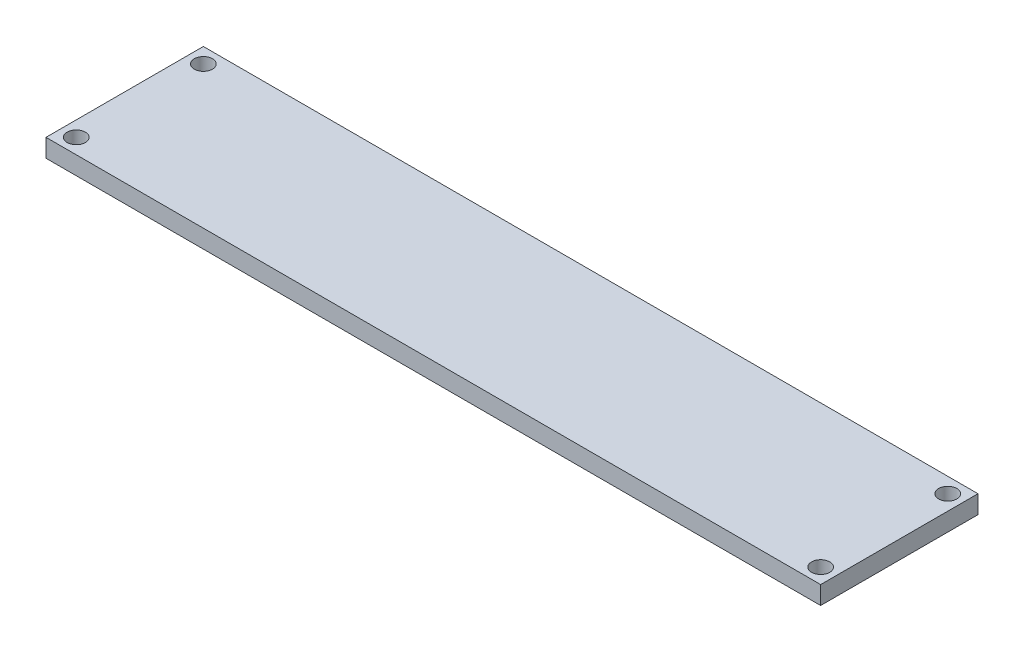
ISO-10303-21;
HEADER;
FILE_DESCRIPTION(('STEP AP214'),'2;1');
FILE_NAME('part.step','',(''),(''),'','','');
FILE_SCHEMA(('AUTOMOTIVE_DESIGN { 1 0 10303 214 1 1 1 1 }'));
ENDSEC;
DATA;
#1=APPLICATION_CONTEXT('core data for automotive mechanical design processes');
#2=APPLICATION_PROTOCOL_DEFINITION('international standard','automotive_design',2000,#1);
#3=PRODUCT_CONTEXT('',#1,'mechanical');
#4=PRODUCT('Part','Part','',(#3));
#5=PRODUCT_RELATED_PRODUCT_CATEGORY('part','',(#4));
#6=PRODUCT_DEFINITION_FORMATION('','',#4);
#7=PRODUCT_DEFINITION_CONTEXT('part definition',#1,'design');
#8=PRODUCT_DEFINITION('design','',#6,#7);
#9=PRODUCT_DEFINITION_SHAPE('','',#8);
#10=(LENGTH_UNIT() NAMED_UNIT(*) SI_UNIT(.MILLI.,.METRE.));
#11=(NAMED_UNIT(*) PLANE_ANGLE_UNIT() SI_UNIT($,.RADIAN.));
#12=(NAMED_UNIT(*) SI_UNIT($,.STERADIAN.) SOLID_ANGLE_UNIT());
#13=UNCERTAINTY_MEASURE_WITH_UNIT(LENGTH_MEASURE(1.E-05),#10,'distance_accuracy_value','');
#14=(GEOMETRIC_REPRESENTATION_CONTEXT(3) GLOBAL_UNCERTAINTY_ASSIGNED_CONTEXT((#13)) GLOBAL_UNIT_ASSIGNED_CONTEXT((#10,
#11,#12)) REPRESENTATION_CONTEXT('',''));
#15=CARTESIAN_POINT('',(0.,0.,0.));
#16=DIRECTION('',(0.,0.,1.));
#17=DIRECTION('',(1.,0.,0.));
#18=AXIS2_PLACEMENT_3D('',#15,#16,#17);
#19=CARTESIAN_POINT('',(64.,-3.,13.));
#20=DIRECTION('',(1.,0.,0.));
#21=DIRECTION('',(0.,0.,-1.));
#22=AXIS2_PLACEMENT_3D('',#19,#20,#21);
#23=PLANE('',#22);
#24=DIRECTION('',(0.,0.,-1.));
#25=VECTOR('',#24,1.);
#26=CARTESIAN_POINT('',(64.,0.,13.));
#27=LINE('',#26,#25);
#28=CARTESIAN_POINT('',(64.,0.,13.));
#29=VERTEX_POINT('',#28);
#30=CARTESIAN_POINT('',(64.,0.,-13.));
#31=VERTEX_POINT('',#30);
#32=EDGE_CURVE('E101',#29,#31,#27,.T.);
#33=ORIENTED_EDGE('',*,*,#32,.F.);
#34=DIRECTION('',(0.,1.,0.));
#35=VECTOR('',#34,1.);
#36=CARTESIAN_POINT('',(64.,-3.,13.));
#37=LINE('',#36,#35);
#38=CARTESIAN_POINT('',(64.,-3.,13.));
#39=VERTEX_POINT('',#38);
#40=EDGE_CURVE('E11',#39,#29,#37,.T.);
#41=ORIENTED_EDGE('',*,*,#40,.F.);
#42=DIRECTION('',(0.,0.,-1.));
#43=VECTOR('',#42,1.);
#44=CARTESIAN_POINT('',(64.,-3.,13.));
#45=LINE('',#44,#43);
#46=CARTESIAN_POINT('',(64.,-3.,-13.));
#47=VERTEX_POINT('',#46);
#48=EDGE_CURVE('E94',#39,#47,#45,.T.);
#49=ORIENTED_EDGE('',*,*,#48,.T.);
#50=DIRECTION('',(0.,1.,0.));
#51=VECTOR('',#50,1.);
#52=CARTESIAN_POINT('',(64.,-3.,-13.));
#53=LINE('',#52,#51);
#54=EDGE_CURVE('E39',#47,#31,#53,.T.);
#55=ORIENTED_EDGE('',*,*,#54,.T.);
#56=EDGE_LOOP('',(#33,#41,#49,#55));
#57=FACE_BOUND('',#56,.T.);
#58=ADVANCED_FACE('F36',(#57),#23,.T.);
#59=CARTESIAN_POINT('',(-64.,-3.,13.));
#60=DIRECTION('',(0.,0.,1.));
#61=DIRECTION('',(1.,0.,0.));
#62=AXIS2_PLACEMENT_3D('',#59,#60,#61);
#63=PLANE('',#62);
#64=DIRECTION('',(1.,0.,0.));
#65=VECTOR('',#64,1.);
#66=CARTESIAN_POINT('',(-64.,0.,13.));
#67=LINE('',#66,#65);
#68=CARTESIAN_POINT('',(-64.,0.,13.));
#69=VERTEX_POINT('',#68);
#70=EDGE_CURVE('E96',#69,#29,#67,.T.);
#71=ORIENTED_EDGE('',*,*,#70,.F.);
#72=DIRECTION('',(0.,1.,0.));
#73=VECTOR('',#72,1.);
#74=CARTESIAN_POINT('',(-64.,-3.,13.));
#75=LINE('',#74,#73);
#76=CARTESIAN_POINT('',(-64.,-3.,13.));
#77=VERTEX_POINT('',#76);
#78=EDGE_CURVE('E45',#77,#69,#75,.T.);
#79=ORIENTED_EDGE('',*,*,#78,.F.);
#80=DIRECTION('',(1.,0.,0.));
#81=VECTOR('',#80,1.);
#82=CARTESIAN_POINT('',(-64.,-3.,13.));
#83=LINE('',#82,#81);
#84=EDGE_CURVE('E91',#77,#39,#83,.T.);
#85=ORIENTED_EDGE('',*,*,#84,.T.);
#86=ORIENTED_EDGE('',*,*,#40,.T.);
#87=EDGE_LOOP('',(#71,#79,#85,#86));
#88=FACE_BOUND('',#87,.T.);
#89=ADVANCED_FACE('F112',(#88),#63,.T.);
#90=CARTESIAN_POINT('',(-64.,-3.,13.));
#91=DIRECTION('',(-1.,0.,0.));
#92=DIRECTION('',(0.,0.,1.));
#93=AXIS2_PLACEMENT_3D('',#90,#91,#92);
#94=PLANE('',#93);
#95=DIRECTION('',(0.,0.,1.));
#96=VECTOR('',#95,1.);
#97=CARTESIAN_POINT('',(-64.,0.,13.));
#98=LINE('',#97,#96);
#99=CARTESIAN_POINT('',(-64.,0.,-13.));
#100=VERTEX_POINT('',#99);
#101=EDGE_CURVE('E86',#100,#69,#98,.T.);
#102=ORIENTED_EDGE('',*,*,#101,.F.);
#103=DIRECTION('',(0.,1.,0.));
#104=VECTOR('',#103,1.);
#105=CARTESIAN_POINT('',(-64.,-3.,-13.));
#106=LINE('',#105,#104);
#107=CARTESIAN_POINT('',(-64.,-3.,-13.));
#108=VERTEX_POINT('',#107);
#109=EDGE_CURVE('E81',#108,#100,#106,.T.);
#110=ORIENTED_EDGE('',*,*,#109,.F.);
#111=DIRECTION('',(0.,0.,1.));
#112=VECTOR('',#111,1.);
#113=CARTESIAN_POINT('',(-64.,-3.,13.));
#114=LINE('',#113,#112);
#115=EDGE_CURVE('E84',#108,#77,#114,.T.);
#116=ORIENTED_EDGE('',*,*,#115,.T.);
#117=ORIENTED_EDGE('',*,*,#78,.T.);
#118=EDGE_LOOP('',(#102,#110,#116,#117));
#119=FACE_BOUND('',#118,.T.);
#120=ADVANCED_FACE('F83',(#119),#94,.T.);
#121=CARTESIAN_POINT('',(-64.,-3.,-13.));
#122=DIRECTION('',(0.,0.,-1.));
#123=DIRECTION('',(-1.,0.,0.));
#124=AXIS2_PLACEMENT_3D('',#121,#122,#123);
#125=PLANE('',#124);
#126=DIRECTION('',(-1.,0.,0.));
#127=VECTOR('',#126,1.);
#128=CARTESIAN_POINT('',(-64.,0.,-13.));
#129=LINE('',#128,#127);
#130=EDGE_CURVE('E104',#31,#100,#129,.T.);
#131=ORIENTED_EDGE('',*,*,#130,.F.);
#132=ORIENTED_EDGE('',*,*,#54,.F.);
#133=DIRECTION('',(-1.,0.,0.));
#134=VECTOR('',#133,1.);
#135=CARTESIAN_POINT('',(-64.,-3.,-13.));
#136=LINE('',#135,#134);
#137=EDGE_CURVE('E90',#47,#108,#136,.T.);
#138=ORIENTED_EDGE('',*,*,#137,.T.);
#139=ORIENTED_EDGE('',*,*,#109,.T.);
#140=EDGE_LOOP('',(#131,#132,#138,#139));
#141=FACE_BOUND('',#140,.T.);
#142=ADVANCED_FACE('F93',(#141),#125,.T.);
#143=CARTESIAN_POINT('',(0.,-3.,0.));
#144=DIRECTION('',(0.,-1.,0.));
#145=DIRECTION('',(0.,0.,-1.));
#146=AXIS2_PLACEMENT_3D('',#143,#144,#145);
#147=PLANE('',#146);
#148=CARTESIAN_POINT('',(-61.5,-3.,10.5));
#149=DIRECTION('',(0.,1.,0.));
#150=DIRECTION('',(0.,0.,1.));
#151=AXIS2_PLACEMENT_3D('',#148,#149,#150);
#152=CIRCLE('',#151,1.5);
#153=CARTESIAN_POINT('',(-61.5,-3.,12.));
#154=VERTEX_POINT('',#153);
#155=EDGE_CURVE('E153',#154,#154,#152,.T.);
#156=ORIENTED_EDGE('',*,*,#155,.T.);
#157=EDGE_LOOP('',(#156));
#158=FACE_BOUND('',#157,.T.);
#159=CARTESIAN_POINT('',(61.5,-3.,10.5));
#160=DIRECTION('',(0.,1.,0.));
#161=DIRECTION('',(0.,0.,1.));
#162=AXIS2_PLACEMENT_3D('',#159,#160,#161);
#163=CIRCLE('',#162,1.49999999999999);
#164=CARTESIAN_POINT('',(61.5,-3.,12.));
#165=VERTEX_POINT('',#164);
#166=EDGE_CURVE('E161',#165,#165,#163,.T.);
#167=ORIENTED_EDGE('',*,*,#166,.T.);
#168=EDGE_LOOP('',(#167));
#169=FACE_BOUND('',#168,.T.);
#170=CARTESIAN_POINT('',(61.5,-3.,-10.5));
#171=DIRECTION('',(0.,1.,0.));
#172=DIRECTION('',(0.,0.,1.));
#173=AXIS2_PLACEMENT_3D('',#170,#171,#172);
#174=CIRCLE('',#173,1.49999999999999);
#175=CARTESIAN_POINT('',(61.5,-3.,-9.00000000000001));
#176=VERTEX_POINT('',#175);
#177=EDGE_CURVE('E167',#176,#176,#174,.T.);
#178=ORIENTED_EDGE('',*,*,#177,.T.);
#179=EDGE_LOOP('',(#178));
#180=FACE_BOUND('',#179,.T.);
#181=CARTESIAN_POINT('',(-61.5,-3.,-10.5));
#182=DIRECTION('',(0.,1.,0.));
#183=DIRECTION('',(0.,0.,1.));
#184=AXIS2_PLACEMENT_3D('',#181,#182,#183);
#185=CIRCLE('',#184,1.5);
#186=CARTESIAN_POINT('',(-61.5,-3.,-9.));
#187=VERTEX_POINT('',#186);
#188=EDGE_CURVE('E105',#187,#187,#185,.T.);
#189=ORIENTED_EDGE('',*,*,#188,.T.);
#190=EDGE_LOOP('',(#189));
#191=FACE_BOUND('',#190,.T.);
#192=ORIENTED_EDGE('',*,*,#48,.F.);
#193=ORIENTED_EDGE('',*,*,#84,.F.);
#194=ORIENTED_EDGE('',*,*,#115,.F.);
#195=ORIENTED_EDGE('',*,*,#137,.F.);
#196=EDGE_LOOP('',(#192,#193,#194,#195));
#197=FACE_BOUND('',#196,.T.);
#198=ADVANCED_FACE('F89',(#158,#169,#180,#191,#197),#147,.T.);
#199=CARTESIAN_POINT('',(0.,0.,0.));
#200=DIRECTION('',(0.,-1.,0.));
#201=DIRECTION('',(0.,0.,-1.));
#202=AXIS2_PLACEMENT_3D('',#199,#200,#201);
#203=PLANE('',#202);
#204=CARTESIAN_POINT('',(-61.5,0.,10.5));
#205=DIRECTION('',(0.,1.,0.));
#206=DIRECTION('',(0.,0.,1.));
#207=AXIS2_PLACEMENT_3D('',#204,#205,#206);
#208=CIRCLE('',#207,1.5);
#209=CARTESIAN_POINT('',(-61.5,0.,12.));
#210=VERTEX_POINT('',#209);
#211=EDGE_CURVE('E156',#210,#210,#208,.T.);
#212=ORIENTED_EDGE('',*,*,#211,.F.);
#213=EDGE_LOOP('',(#212));
#214=FACE_BOUND('',#213,.T.);
#215=CARTESIAN_POINT('',(61.5,0.,10.5));
#216=DIRECTION('',(0.,1.,0.));
#217=DIRECTION('',(0.,0.,1.));
#218=AXIS2_PLACEMENT_3D('',#215,#216,#217);
#219=CIRCLE('',#218,1.49999999999999);
#220=CARTESIAN_POINT('',(61.5,0.,12.));
#221=VERTEX_POINT('',#220);
#222=EDGE_CURVE('E158',#221,#221,#219,.T.);
#223=ORIENTED_EDGE('',*,*,#222,.F.);
#224=EDGE_LOOP('',(#223));
#225=FACE_BOUND('',#224,.T.);
#226=CARTESIAN_POINT('',(61.5,0.,-10.5));
#227=DIRECTION('',(0.,1.,0.));
#228=DIRECTION('',(0.,0.,1.));
#229=AXIS2_PLACEMENT_3D('',#226,#227,#228);
#230=CIRCLE('',#229,1.49999999999999);
#231=CARTESIAN_POINT('',(61.5,0.,-9.00000000000001));
#232=VERTEX_POINT('',#231);
#233=EDGE_CURVE('E164',#232,#232,#230,.T.);
#234=ORIENTED_EDGE('',*,*,#233,.F.);
#235=EDGE_LOOP('',(#234));
#236=FACE_BOUND('',#235,.T.);
#237=CARTESIAN_POINT('',(-61.5,0.,-10.5));
#238=DIRECTION('',(0.,1.,0.));
#239=DIRECTION('',(0.,0.,1.));
#240=AXIS2_PLACEMENT_3D('',#237,#238,#239);
#241=CIRCLE('',#240,1.5);
#242=CARTESIAN_POINT('',(-61.5,0.,-9.));
#243=VERTEX_POINT('',#242);
#244=EDGE_CURVE('E170',#243,#243,#241,.T.);
#245=ORIENTED_EDGE('',*,*,#244,.F.);
#246=EDGE_LOOP('',(#245));
#247=FACE_BOUND('',#246,.T.);
#248=ORIENTED_EDGE('',*,*,#32,.T.);
#249=ORIENTED_EDGE('',*,*,#130,.T.);
#250=ORIENTED_EDGE('',*,*,#101,.T.);
#251=ORIENTED_EDGE('',*,*,#70,.T.);
#252=EDGE_LOOP('',(#248,#249,#250,#251));
#253=FACE_BOUND('',#252,.T.);
#254=ADVANCED_FACE('F111',(#214,#225,#236,#247,#253),#203,.F.);
#255=CARTESIAN_POINT('',(-61.5,-3.,-10.5));
#256=DIRECTION('',(0.,1.,0.));
#257=DIRECTION('',(0.,0.,1.));
#258=AXIS2_PLACEMENT_3D('',#255,#256,#257);
#259=CYLINDRICAL_SURFACE('',#258,1.5);
#260=ORIENTED_EDGE('',*,*,#188,.F.);
#261=EDGE_LOOP('',(#260));
#262=FACE_BOUND('',#261,.T.);
#263=ORIENTED_EDGE('',*,*,#244,.T.);
#264=EDGE_LOOP('',(#263));
#265=FACE_BOUND('',#264,.T.);
#266=ADVANCED_FACE('F130',(#262,#265),#259,.F.);
#267=CARTESIAN_POINT('',(61.5,-3.,-10.5));
#268=DIRECTION('',(0.,1.,0.));
#269=DIRECTION('',(0.,0.,1.));
#270=AXIS2_PLACEMENT_3D('',#267,#268,#269);
#271=CYLINDRICAL_SURFACE('',#270,1.49999999999999);
#272=ORIENTED_EDGE('',*,*,#177,.F.);
#273=EDGE_LOOP('',(#272));
#274=FACE_BOUND('',#273,.T.);
#275=ORIENTED_EDGE('',*,*,#233,.T.);
#276=EDGE_LOOP('',(#275));
#277=FACE_BOUND('',#276,.T.);
#278=ADVANCED_FACE('F137',(#274,#277),#271,.F.);
#279=CARTESIAN_POINT('',(61.5,-3.,10.5));
#280=DIRECTION('',(0.,1.,0.));
#281=DIRECTION('',(0.,0.,1.));
#282=AXIS2_PLACEMENT_3D('',#279,#280,#281);
#283=CYLINDRICAL_SURFACE('',#282,1.49999999999999);
#284=ORIENTED_EDGE('',*,*,#166,.F.);
#285=EDGE_LOOP('',(#284));
#286=FACE_BOUND('',#285,.T.);
#287=ORIENTED_EDGE('',*,*,#222,.T.);
#288=EDGE_LOOP('',(#287));
#289=FACE_BOUND('',#288,.T.);
#290=ADVANCED_FACE('F141',(#286,#289),#283,.F.);
#291=CARTESIAN_POINT('',(-61.5,-3.,10.5));
#292=DIRECTION('',(0.,1.,0.));
#293=DIRECTION('',(0.,0.,1.));
#294=AXIS2_PLACEMENT_3D('',#291,#292,#293);
#295=CYLINDRICAL_SURFACE('',#294,1.5);
#296=ORIENTED_EDGE('',*,*,#155,.F.);
#297=EDGE_LOOP('',(#296));
#298=FACE_BOUND('',#297,.T.);
#299=ORIENTED_EDGE('',*,*,#211,.T.);
#300=EDGE_LOOP('',(#299));
#301=FACE_BOUND('',#300,.T.);
#302=ADVANCED_FACE('F145',(#298,#301),#295,.F.);
#303=CLOSED_SHELL('',(#58,#89,#120,#142,#198,#254,#266,#278,#290,#302));
#304=MANIFOLD_SOLID_BREP('B2',#303);
#305=ADVANCED_BREP_SHAPE_REPRESENTATION('',(#18,#304),#14);
#306=SHAPE_DEFINITION_REPRESENTATION(#9,#305);
ENDSEC;
END-ISO-10303-21;
